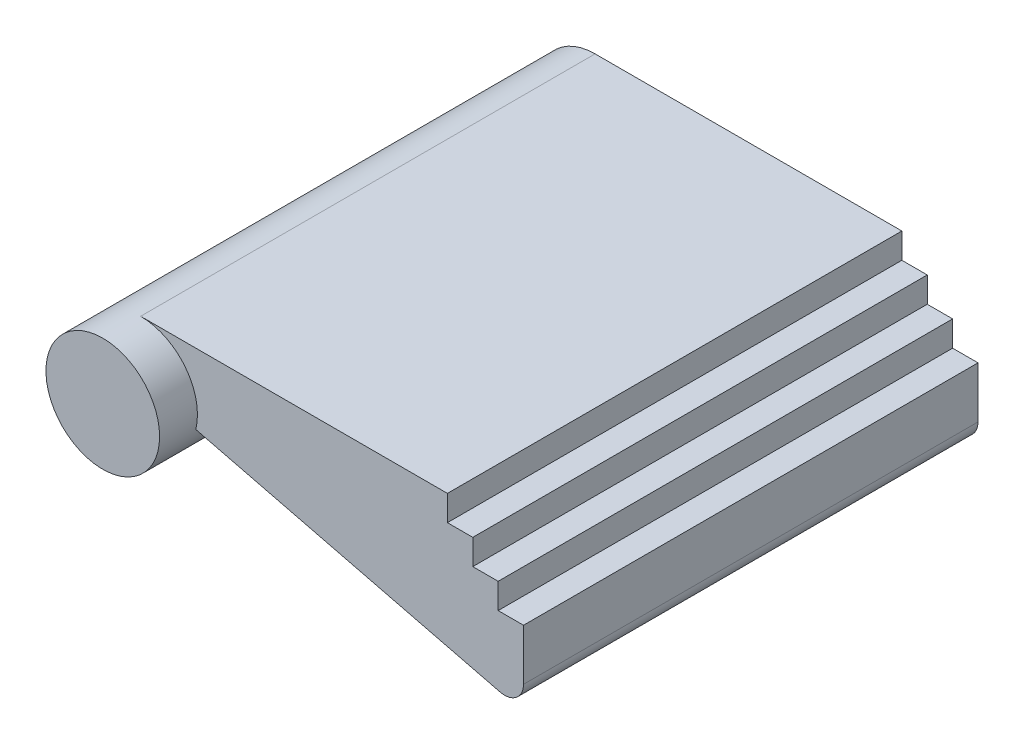
ISO-10303-21;
HEADER;
FILE_DESCRIPTION(('STEP AP214'),'2;1');
FILE_NAME('part.step','',(''),(''),'','','');
FILE_SCHEMA(('AUTOMOTIVE_DESIGN { 1 0 10303 214 1 1 1 1 }'));
ENDSEC;
DATA;
#1=APPLICATION_CONTEXT('core data for automotive mechanical design processes');
#2=APPLICATION_PROTOCOL_DEFINITION('international standard','automotive_design',2000,#1);
#3=PRODUCT_CONTEXT('',#1,'mechanical');
#4=PRODUCT('Part','Part','',(#3));
#5=PRODUCT_RELATED_PRODUCT_CATEGORY('part','',(#4));
#6=PRODUCT_DEFINITION_FORMATION('','',#4);
#7=PRODUCT_DEFINITION_CONTEXT('part definition',#1,'design');
#8=PRODUCT_DEFINITION('design','',#6,#7);
#9=PRODUCT_DEFINITION_SHAPE('','',#8);
#10=(LENGTH_UNIT() NAMED_UNIT(*) SI_UNIT(.MILLI.,.METRE.));
#11=(NAMED_UNIT(*) PLANE_ANGLE_UNIT() SI_UNIT($,.RADIAN.));
#12=(NAMED_UNIT(*) SI_UNIT($,.STERADIAN.) SOLID_ANGLE_UNIT());
#13=UNCERTAINTY_MEASURE_WITH_UNIT(LENGTH_MEASURE(1.E-05),#10,'distance_accuracy_value','');
#14=(GEOMETRIC_REPRESENTATION_CONTEXT(3) GLOBAL_UNCERTAINTY_ASSIGNED_CONTEXT((#13)) GLOBAL_UNIT_ASSIGNED_CONTEXT((#10,
#11,#12)) REPRESENTATION_CONTEXT('',''));
#15=CARTESIAN_POINT('',(0.,0.,0.));
#16=DIRECTION('',(0.,0.,1.));
#17=DIRECTION('',(1.,0.,0.));
#18=AXIS2_PLACEMENT_3D('',#15,#16,#17);
#19=CARTESIAN_POINT('',(0.,0.,13.));
#20=DIRECTION('',(0.,0.,-1.));
#21=DIRECTION('',(-1.,0.,0.));
#22=AXIS2_PLACEMENT_3D('',#19,#20,#21);
#23=CYLINDRICAL_SURFACE('',#22,1.5);
#24=CARTESIAN_POINT('',(0.,0.,13.));
#25=DIRECTION('',(0.,0.,1.));
#26=DIRECTION('',(1.,0.,0.));
#27=AXIS2_PLACEMENT_3D('',#24,#25,#26);
#28=CIRCLE('',#27,1.5);
#29=CARTESIAN_POINT('',(1.5,0.,13.));
#30=VERTEX_POINT('',#29);
#31=EDGE_CURVE('E196',#30,#30,#28,.T.);
#32=ORIENTED_EDGE('',*,*,#31,.F.);
#33=EDGE_LOOP('',(#32));
#34=FACE_BOUND('',#33,.T.);
#35=DIRECTION('',(0.,0.,-1.));
#36=VECTOR('',#35,1.);
#37=CARTESIAN_POINT('',(1.45614093271805,-0.360074414618706,13.));
#38=LINE('',#37,#36);
#39=CARTESIAN_POINT('',(1.45614093271805,-0.360074414618707,12.));
#40=VERTEX_POINT('',#39);
#41=CARTESIAN_POINT('',(1.45614093271805,-0.360074414618707,0.));
#42=VERTEX_POINT('',#41);
#43=EDGE_CURVE('E134',#40,#42,#38,.T.);
#44=ORIENTED_EDGE('',*,*,#43,.F.);
#45=CARTESIAN_POINT('',(0.,0.,12.));
#46=DIRECTION('',(0.,0.,-1.));
#47=DIRECTION('',(-1.,0.,0.));
#48=AXIS2_PLACEMENT_3D('',#45,#46,#47);
#49=CIRCLE('',#48,1.5);
#50=CARTESIAN_POINT('',(0.,1.5,12.));
#51=VERTEX_POINT('',#50);
#52=EDGE_CURVE('E199',#51,#40,#49,.T.);
#53=ORIENTED_EDGE('',*,*,#52,.F.);
#54=DIRECTION('',(0.,0.,-1.));
#55=VECTOR('',#54,1.);
#56=CARTESIAN_POINT('',(0.,1.5,12.));
#57=LINE('',#56,#55);
#58=CARTESIAN_POINT('',(0.,1.5,0.));
#59=VERTEX_POINT('',#58);
#60=EDGE_CURVE('E156',#51,#59,#57,.T.);
#61=ORIENTED_EDGE('',*,*,#60,.T.);
#62=CARTESIAN_POINT('',(0.,0.,0.));
#63=DIRECTION('',(0.,0.,1.));
#64=DIRECTION('',(1.,0.,0.));
#65=AXIS2_PLACEMENT_3D('',#62,#63,#64);
#66=CIRCLE('',#65,1.5);
#67=EDGE_CURVE('E195',#59,#42,#66,.T.);
#68=ORIENTED_EDGE('',*,*,#67,.T.);
#69=EDGE_LOOP('',(#44,#53,#61,#68));
#70=FACE_BOUND('',#69,.T.);
#71=ADVANCED_FACE('F34',(#34,#70),#23,.T.);
#72=CARTESIAN_POINT('',(0.,0.,13.));
#73=DIRECTION('',(0.,0.,1.));
#74=DIRECTION('',(1.,0.,0.));
#75=AXIS2_PLACEMENT_3D('',#72,#73,#74);
#76=PLANE('',#75);
#77=ORIENTED_EDGE('',*,*,#31,.T.);
#78=EDGE_LOOP('',(#77));
#79=FACE_BOUND('',#78,.T.);
#80=ADVANCED_FACE('F244',(#79),#76,.T.);
#81=CARTESIAN_POINT('',(0.,0.,0.));
#82=DIRECTION('',(0.,0.,1.));
#83=DIRECTION('',(1.,0.,0.));
#84=AXIS2_PLACEMENT_3D('',#81,#82,#83);
#85=PLANE('',#84);
#86=DIRECTION('',(0.,1.,0.));
#87=VECTOR('',#86,1.);
#88=CARTESIAN_POINT('',(10.11,-0.51,0.));
#89=LINE('',#88,#87);
#90=CARTESIAN_POINT('',(10.11,-1.86130000440731,0.));
#91=VERTEX_POINT('',#90);
#92=CARTESIAN_POINT('',(10.11,-0.51,0.));
#93=VERTEX_POINT('',#92);
#94=EDGE_CURVE('E131',#91,#93,#89,.T.);
#95=ORIENTED_EDGE('',*,*,#94,.F.);
#96=CARTESIAN_POINT('',(9.61,-1.86130000440731,0.));
#97=DIRECTION('',(0.,0.,1.));
#98=DIRECTION('',(1.,0.,0.));
#99=AXIS2_PLACEMENT_3D('',#96,#97,#98);
#100=CIRCLE('',#99,0.5);
#101=CARTESIAN_POINT('',(9.4899751951271,-2.34668031531333,0.));
#102=VERTEX_POINT('',#101);
#103=EDGE_CURVE('E56',#91,#102,#100,.F.);
#104=ORIENTED_EDGE('',*,*,#103,.T.);
#105=DIRECTION('',(0.970760621812034,-0.240049609745805,0.));
#106=VECTOR('',#105,1.);
#107=CARTESIAN_POINT('',(10.11,-2.5,0.));
#108=LINE('',#107,#106);
#109=EDGE_CURVE('E157',#42,#102,#108,.T.);
#110=ORIENTED_EDGE('',*,*,#109,.F.);
#111=ORIENTED_EDGE('',*,*,#67,.F.);
#112=DIRECTION('',(-1.,0.,0.));
#113=VECTOR('',#112,1.);
#114=CARTESIAN_POINT('',(0.,1.5,0.));
#115=LINE('',#114,#113);
#116=CARTESIAN_POINT('',(8.1,1.5,0.));
#117=VERTEX_POINT('',#116);
#118=EDGE_CURVE('E172',#117,#59,#115,.T.);
#119=ORIENTED_EDGE('',*,*,#118,.F.);
#120=DIRECTION('',(0.,1.,0.));
#121=VECTOR('',#120,1.);
#122=CARTESIAN_POINT('',(8.1,1.5,0.));
#123=LINE('',#122,#121);
#124=CARTESIAN_POINT('',(8.1,0.83,0.));
#125=VERTEX_POINT('',#124);
#126=EDGE_CURVE('E170',#125,#117,#123,.T.);
#127=ORIENTED_EDGE('',*,*,#126,.F.);
#128=DIRECTION('',(-1.,0.,0.));
#129=VECTOR('',#128,1.);
#130=CARTESIAN_POINT('',(8.1,0.83,0.));
#131=LINE('',#130,#129);
#132=CARTESIAN_POINT('',(8.77,0.83,0.));
#133=VERTEX_POINT('',#132);
#134=EDGE_CURVE('E168',#133,#125,#131,.T.);
#135=ORIENTED_EDGE('',*,*,#134,.F.);
#136=DIRECTION('',(0.,1.,0.));
#137=VECTOR('',#136,1.);
#138=CARTESIAN_POINT('',(8.77,0.83,0.));
#139=LINE('',#138,#137);
#140=CARTESIAN_POINT('',(8.77,0.16,0.));
#141=VERTEX_POINT('',#140);
#142=EDGE_CURVE('E166',#141,#133,#139,.T.);
#143=ORIENTED_EDGE('',*,*,#142,.F.);
#144=DIRECTION('',(-1.,0.,0.));
#145=VECTOR('',#144,1.);
#146=CARTESIAN_POINT('',(8.77,0.16,0.));
#147=LINE('',#146,#145);
#148=CARTESIAN_POINT('',(9.44,0.16,0.));
#149=VERTEX_POINT('',#148);
#150=EDGE_CURVE('E164',#149,#141,#147,.T.);
#151=ORIENTED_EDGE('',*,*,#150,.F.);
#152=DIRECTION('',(0.,1.,0.));
#153=VECTOR('',#152,1.);
#154=CARTESIAN_POINT('',(9.44,0.16,0.));
#155=LINE('',#154,#153);
#156=CARTESIAN_POINT('',(9.44,-0.51,0.));
#157=VERTEX_POINT('',#156);
#158=EDGE_CURVE('E162',#157,#149,#155,.T.);
#159=ORIENTED_EDGE('',*,*,#158,.F.);
#160=DIRECTION('',(-1.,0.,0.));
#161=VECTOR('',#160,1.);
#162=CARTESIAN_POINT('',(9.44,-0.51,0.));
#163=LINE('',#162,#161);
#164=EDGE_CURVE('E160',#93,#157,#163,.T.);
#165=ORIENTED_EDGE('',*,*,#164,.F.);
#166=EDGE_LOOP('',(#95,#104,#110,#111,#119,#127,#135,#143,#151,#159,#165));
#167=FACE_BOUND('',#166,.T.);
#168=ADVANCED_FACE('F206',(#167),#85,.F.);
#169=CARTESIAN_POINT('',(10.11,-2.5,12.));
#170=DIRECTION('',(0.240049609745805,0.970760621812034,0.));
#171=DIRECTION('',(-0.970760621812034,0.240049609745805,0.));
#172=AXIS2_PLACEMENT_3D('',#169,#170,#171);
#173=PLANE('',#172);
#174=ORIENTED_EDGE('',*,*,#109,.T.);
#175=DIRECTION('',(0.,0.,-1.));
#176=VECTOR('',#175,1.);
#177=CARTESIAN_POINT('',(9.4899751951271,-2.34668031531333,12.));
#178=LINE('',#177,#176);
#179=CARTESIAN_POINT('',(9.4899751951271,-2.34668031531333,12.));
#180=VERTEX_POINT('',#179);
#181=EDGE_CURVE('E42',#102,#180,#178,.F.);
#182=ORIENTED_EDGE('',*,*,#181,.T.);
#183=DIRECTION('',(0.970760621812034,-0.240049609745805,0.));
#184=VECTOR('',#183,1.);
#185=CARTESIAN_POINT('',(10.11,-2.5,12.));
#186=LINE('',#185,#184);
#187=EDGE_CURVE('E126',#40,#180,#186,.T.);
#188=ORIENTED_EDGE('',*,*,#187,.F.);
#189=ORIENTED_EDGE('',*,*,#43,.T.);
#190=EDGE_LOOP('',(#174,#182,#188,#189));
#191=FACE_BOUND('',#190,.T.);
#192=ADVANCED_FACE('F237',(#191),#173,.F.);
#193=CARTESIAN_POINT('',(10.11,-0.51,12.));
#194=DIRECTION('',(-1.,0.,0.));
#195=DIRECTION('',(0.,0.,1.));
#196=AXIS2_PLACEMENT_3D('',#193,#194,#195);
#197=PLANE('',#196);
#198=DIRECTION('',(0.,1.,0.));
#199=VECTOR('',#198,1.);
#200=CARTESIAN_POINT('',(10.11,-0.51,12.));
#201=LINE('',#200,#199);
#202=CARTESIAN_POINT('',(10.11,-1.86130000440731,12.));
#203=VERTEX_POINT('',#202);
#204=CARTESIAN_POINT('',(10.11,-0.51,12.));
#205=VERTEX_POINT('',#204);
#206=EDGE_CURVE('E116',#203,#205,#201,.T.);
#207=ORIENTED_EDGE('',*,*,#206,.F.);
#208=DIRECTION('',(0.,0.,-1.));
#209=VECTOR('',#208,1.);
#210=CARTESIAN_POINT('',(10.11,-1.86130000440731,12.));
#211=LINE('',#210,#209);
#212=EDGE_CURVE('E203',#203,#91,#211,.T.);
#213=ORIENTED_EDGE('',*,*,#212,.T.);
#214=ORIENTED_EDGE('',*,*,#94,.T.);
#215=DIRECTION('',(0.,0.,-1.));
#216=VECTOR('',#215,1.);
#217=CARTESIAN_POINT('',(10.11,-0.51,12.));
#218=LINE('',#217,#216);
#219=EDGE_CURVE('E129',#205,#93,#218,.T.);
#220=ORIENTED_EDGE('',*,*,#219,.F.);
#221=EDGE_LOOP('',(#207,#213,#214,#220));
#222=FACE_BOUND('',#221,.T.);
#223=ADVANCED_FACE('F130',(#222),#197,.F.);
#224=CARTESIAN_POINT('',(9.44,-0.51,12.));
#225=DIRECTION('',(0.,-1.,0.));
#226=DIRECTION('',(1.,0.,0.));
#227=AXIS2_PLACEMENT_3D('',#224,#225,#226);
#228=PLANE('',#227);
#229=ORIENTED_EDGE('',*,*,#164,.T.);
#230=DIRECTION('',(0.,0.,-1.));
#231=VECTOR('',#230,1.);
#232=CARTESIAN_POINT('',(9.44,-0.51,12.));
#233=LINE('',#232,#231);
#234=CARTESIAN_POINT('',(9.44,-0.51,12.));
#235=VERTEX_POINT('',#234);
#236=EDGE_CURVE('E135',#235,#157,#233,.T.);
#237=ORIENTED_EDGE('',*,*,#236,.F.);
#238=DIRECTION('',(-1.,0.,0.));
#239=VECTOR('',#238,1.);
#240=CARTESIAN_POINT('',(9.44,-0.51,12.));
#241=LINE('',#240,#239);
#242=EDGE_CURVE('E120',#205,#235,#241,.T.);
#243=ORIENTED_EDGE('',*,*,#242,.F.);
#244=ORIENTED_EDGE('',*,*,#219,.T.);
#245=EDGE_LOOP('',(#229,#237,#243,#244));
#246=FACE_BOUND('',#245,.T.);
#247=ADVANCED_FACE('F137',(#246),#228,.F.);
#248=CARTESIAN_POINT('',(9.44,0.16,12.));
#249=DIRECTION('',(-1.,0.,0.));
#250=DIRECTION('',(0.,0.,1.));
#251=AXIS2_PLACEMENT_3D('',#248,#249,#250);
#252=PLANE('',#251);
#253=ORIENTED_EDGE('',*,*,#158,.T.);
#254=DIRECTION('',(0.,0.,-1.));
#255=VECTOR('',#254,1.);
#256=CARTESIAN_POINT('',(9.44,0.16,12.));
#257=LINE('',#256,#255);
#258=CARTESIAN_POINT('',(9.44,0.16,12.));
#259=VERTEX_POINT('',#258);
#260=EDGE_CURVE('E189',#259,#149,#257,.T.);
#261=ORIENTED_EDGE('',*,*,#260,.F.);
#262=DIRECTION('',(0.,1.,0.));
#263=VECTOR('',#262,1.);
#264=CARTESIAN_POINT('',(9.44,0.16,12.));
#265=LINE('',#264,#263);
#266=EDGE_CURVE('E140',#235,#259,#265,.T.);
#267=ORIENTED_EDGE('',*,*,#266,.F.);
#268=ORIENTED_EDGE('',*,*,#236,.T.);
#269=EDGE_LOOP('',(#253,#261,#267,#268));
#270=FACE_BOUND('',#269,.T.);
#271=ADVANCED_FACE('F210',(#270),#252,.F.);
#272=CARTESIAN_POINT('',(8.77,0.16,12.));
#273=DIRECTION('',(0.,-1.,0.));
#274=DIRECTION('',(1.,0.,0.));
#275=AXIS2_PLACEMENT_3D('',#272,#273,#274);
#276=PLANE('',#275);
#277=ORIENTED_EDGE('',*,*,#150,.T.);
#278=DIRECTION('',(0.,0.,-1.));
#279=VECTOR('',#278,1.);
#280=CARTESIAN_POINT('',(8.77,0.16,12.));
#281=LINE('',#280,#279);
#282=CARTESIAN_POINT('',(8.77,0.16,12.));
#283=VERTEX_POINT('',#282);
#284=EDGE_CURVE('E186',#283,#141,#281,.T.);
#285=ORIENTED_EDGE('',*,*,#284,.F.);
#286=DIRECTION('',(-1.,0.,0.));
#287=VECTOR('',#286,1.);
#288=CARTESIAN_POINT('',(8.77,0.16,12.));
#289=LINE('',#288,#287);
#290=EDGE_CURVE('E142',#259,#283,#289,.T.);
#291=ORIENTED_EDGE('',*,*,#290,.F.);
#292=ORIENTED_EDGE('',*,*,#260,.T.);
#293=EDGE_LOOP('',(#277,#285,#291,#292));
#294=FACE_BOUND('',#293,.T.);
#295=ADVANCED_FACE('F217',(#294),#276,.F.);
#296=CARTESIAN_POINT('',(8.77,0.83,12.));
#297=DIRECTION('',(-1.,0.,0.));
#298=DIRECTION('',(0.,0.,1.));
#299=AXIS2_PLACEMENT_3D('',#296,#297,#298);
#300=PLANE('',#299);
#301=ORIENTED_EDGE('',*,*,#142,.T.);
#302=DIRECTION('',(0.,0.,-1.));
#303=VECTOR('',#302,1.);
#304=CARTESIAN_POINT('',(8.77,0.83,12.));
#305=LINE('',#304,#303);
#306=CARTESIAN_POINT('',(8.77,0.83,12.));
#307=VERTEX_POINT('',#306);
#308=EDGE_CURVE('E183',#307,#133,#305,.T.);
#309=ORIENTED_EDGE('',*,*,#308,.F.);
#310=DIRECTION('',(0.,1.,0.));
#311=VECTOR('',#310,1.);
#312=CARTESIAN_POINT('',(8.77,0.83,12.));
#313=LINE('',#312,#311);
#314=EDGE_CURVE('E147',#283,#307,#313,.T.);
#315=ORIENTED_EDGE('',*,*,#314,.F.);
#316=ORIENTED_EDGE('',*,*,#284,.T.);
#317=EDGE_LOOP('',(#301,#309,#315,#316));
#318=FACE_BOUND('',#317,.T.);
#319=ADVANCED_FACE('F220',(#318),#300,.F.);
#320=CARTESIAN_POINT('',(8.1,0.83,12.));
#321=DIRECTION('',(0.,-1.,0.));
#322=DIRECTION('',(0.,0.,-1.));
#323=AXIS2_PLACEMENT_3D('',#320,#321,#322);
#324=PLANE('',#323);
#325=ORIENTED_EDGE('',*,*,#134,.T.);
#326=DIRECTION('',(0.,0.,-1.));
#327=VECTOR('',#326,1.);
#328=CARTESIAN_POINT('',(8.1,0.83,12.));
#329=LINE('',#328,#327);
#330=CARTESIAN_POINT('',(8.1,0.83,12.));
#331=VERTEX_POINT('',#330);
#332=EDGE_CURVE('E180',#331,#125,#329,.T.);
#333=ORIENTED_EDGE('',*,*,#332,.F.);
#334=DIRECTION('',(-1.,0.,0.));
#335=VECTOR('',#334,1.);
#336=CARTESIAN_POINT('',(8.1,0.83,12.));
#337=LINE('',#336,#335);
#338=EDGE_CURVE('E149',#307,#331,#337,.T.);
#339=ORIENTED_EDGE('',*,*,#338,.F.);
#340=ORIENTED_EDGE('',*,*,#308,.T.);
#341=EDGE_LOOP('',(#325,#333,#339,#340));
#342=FACE_BOUND('',#341,.T.);
#343=ADVANCED_FACE('F225',(#342),#324,.F.);
#344=CARTESIAN_POINT('',(8.1,1.5,12.));
#345=DIRECTION('',(-1.,0.,0.));
#346=DIRECTION('',(0.,0.,1.));
#347=AXIS2_PLACEMENT_3D('',#344,#345,#346);
#348=PLANE('',#347);
#349=ORIENTED_EDGE('',*,*,#126,.T.);
#350=DIRECTION('',(0.,0.,-1.));
#351=VECTOR('',#350,1.);
#352=CARTESIAN_POINT('',(8.1,1.5,12.));
#353=LINE('',#352,#351);
#354=CARTESIAN_POINT('',(8.1,1.5,12.));
#355=VERTEX_POINT('',#354);
#356=EDGE_CURVE('E177',#355,#117,#353,.T.);
#357=ORIENTED_EDGE('',*,*,#356,.F.);
#358=DIRECTION('',(0.,1.,0.));
#359=VECTOR('',#358,1.);
#360=CARTESIAN_POINT('',(8.1,1.5,12.));
#361=LINE('',#360,#359);
#362=EDGE_CURVE('E151',#331,#355,#361,.T.);
#363=ORIENTED_EDGE('',*,*,#362,.F.);
#364=ORIENTED_EDGE('',*,*,#332,.T.);
#365=EDGE_LOOP('',(#349,#357,#363,#364));
#366=FACE_BOUND('',#365,.T.);
#367=ADVANCED_FACE('F231',(#366),#348,.F.);
#368=CARTESIAN_POINT('',(0.,1.5,12.));
#369=DIRECTION('',(0.,-1.,0.));
#370=DIRECTION('',(0.,0.,-1.));
#371=AXIS2_PLACEMENT_3D('',#368,#369,#370);
#372=PLANE('',#371);
#373=ORIENTED_EDGE('',*,*,#118,.T.);
#374=ORIENTED_EDGE('',*,*,#60,.F.);
#375=DIRECTION('',(-1.,0.,0.));
#376=VECTOR('',#375,1.);
#377=CARTESIAN_POINT('',(0.,1.5,12.));
#378=LINE('',#377,#376);
#379=EDGE_CURVE('E153',#355,#51,#378,.T.);
#380=ORIENTED_EDGE('',*,*,#379,.F.);
#381=ORIENTED_EDGE('',*,*,#356,.T.);
#382=EDGE_LOOP('',(#373,#374,#380,#381));
#383=FACE_BOUND('',#382,.T.);
#384=ADVANCED_FACE('F235',(#383),#372,.F.);
#385=CARTESIAN_POINT('',(0.,0.,12.));
#386=DIRECTION('',(0.,0.,-1.));
#387=DIRECTION('',(-1.,0.,0.));
#388=AXIS2_PLACEMENT_3D('',#385,#386,#387);
#389=PLANE('',#388);
#390=ORIENTED_EDGE('',*,*,#187,.T.);
#391=CARTESIAN_POINT('',(9.61,-1.86130000440731,12.));
#392=DIRECTION('',(0.,0.,-1.));
#393=DIRECTION('',(-1.,0.,0.));
#394=AXIS2_PLACEMENT_3D('',#391,#392,#393);
#395=CIRCLE('',#394,0.5);
#396=EDGE_CURVE('E11',#180,#203,#395,.F.);
#397=ORIENTED_EDGE('',*,*,#396,.T.);
#398=ORIENTED_EDGE('',*,*,#206,.T.);
#399=ORIENTED_EDGE('',*,*,#242,.T.);
#400=ORIENTED_EDGE('',*,*,#266,.T.);
#401=ORIENTED_EDGE('',*,*,#290,.T.);
#402=ORIENTED_EDGE('',*,*,#314,.T.);
#403=ORIENTED_EDGE('',*,*,#338,.T.);
#404=ORIENTED_EDGE('',*,*,#362,.T.);
#405=ORIENTED_EDGE('',*,*,#379,.T.);
#406=ORIENTED_EDGE('',*,*,#52,.T.);
#407=EDGE_LOOP('',(#390,#397,#398,#399,#400,#401,#402,#403,#404,#405,#406));
#408=FACE_BOUND('',#407,.T.);
#409=ADVANCED_FACE('F118',(#408),#389,.F.);
#410=CARTESIAN_POINT('',(9.61,-1.86130000440731,12.));
#411=DIRECTION('',(0.,0.,-1.));
#412=DIRECTION('',(-1.,0.,0.));
#413=AXIS2_PLACEMENT_3D('',#410,#411,#412);
#414=CYLINDRICAL_SURFACE('',#413,0.5);
#415=ORIENTED_EDGE('',*,*,#396,.F.);
#416=ORIENTED_EDGE('',*,*,#181,.F.);
#417=ORIENTED_EDGE('',*,*,#103,.F.);
#418=ORIENTED_EDGE('',*,*,#212,.F.);
#419=EDGE_LOOP('',(#415,#416,#417,#418));
#420=FACE_BOUND('',#419,.T.);
#421=ADVANCED_FACE('F36',(#420),#414,.T.);
#422=CLOSED_SHELL('',(#71,#80,#168,#192,#223,#247,#271,#295,#319,#343,#367,#384,#409,#421));
#423=MANIFOLD_SOLID_BREP('B2',#422);
#424=ADVANCED_BREP_SHAPE_REPRESENTATION('',(#18,#423),#14);
#425=SHAPE_DEFINITION_REPRESENTATION(#9,#424);
ENDSEC;
END-ISO-10303-21;
